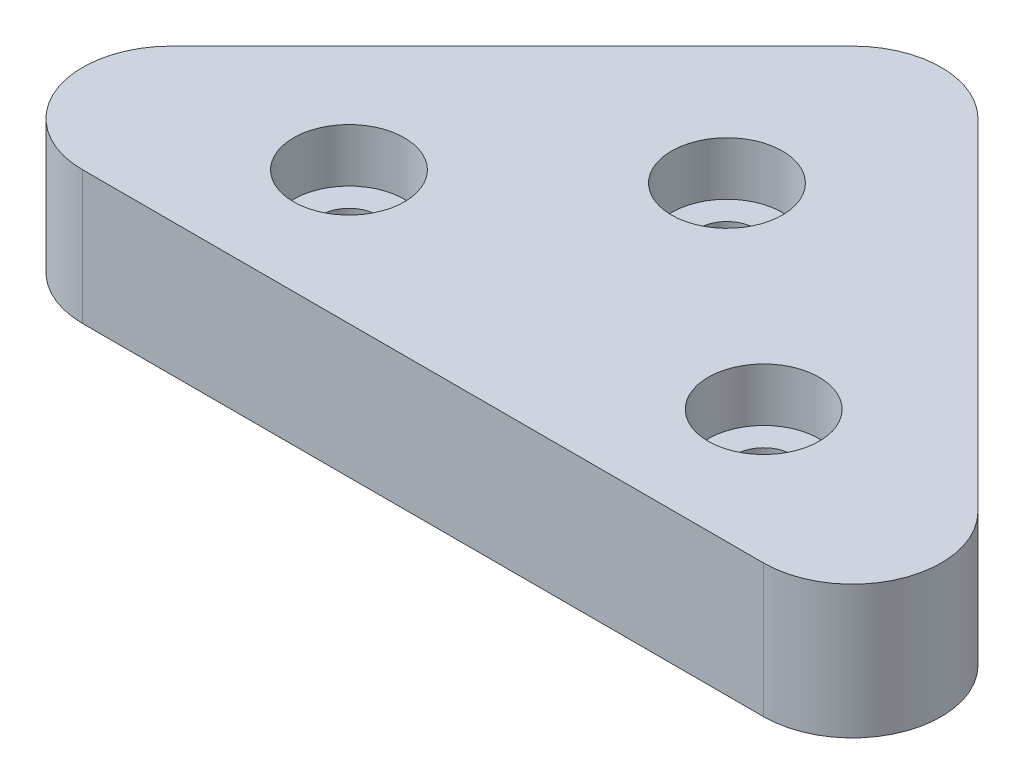
ISO-10303-21;
HEADER;
FILE_DESCRIPTION(('STEP AP214'),'2;1');
FILE_NAME('part.step','',(''),(''),'','','');
FILE_SCHEMA(('AUTOMOTIVE_DESIGN { 1 0 10303 214 1 1 1 1 }'));
ENDSEC;
DATA;
#1=APPLICATION_CONTEXT('core data for automotive mechanical design processes');
#2=APPLICATION_PROTOCOL_DEFINITION('international standard','automotive_design',2000,#1);
#3=PRODUCT_CONTEXT('',#1,'mechanical');
#4=PRODUCT('Part','Part','',(#3));
#5=PRODUCT_RELATED_PRODUCT_CATEGORY('part','',(#4));
#6=PRODUCT_DEFINITION_FORMATION('','',#4);
#7=PRODUCT_DEFINITION_CONTEXT('part definition',#1,'design');
#8=PRODUCT_DEFINITION('design','',#6,#7);
#9=PRODUCT_DEFINITION_SHAPE('','',#8);
#10=(LENGTH_UNIT() NAMED_UNIT(*) SI_UNIT(.MILLI.,.METRE.));
#11=(NAMED_UNIT(*) PLANE_ANGLE_UNIT() SI_UNIT($,.RADIAN.));
#12=(NAMED_UNIT(*) SI_UNIT($,.STERADIAN.) SOLID_ANGLE_UNIT());
#13=UNCERTAINTY_MEASURE_WITH_UNIT(LENGTH_MEASURE(1.E-05),#10,'distance_accuracy_value','');
#14=(GEOMETRIC_REPRESENTATION_CONTEXT(3) GLOBAL_UNCERTAINTY_ASSIGNED_CONTEXT((#13)) GLOBAL_UNIT_ASSIGNED_CONTEXT((#10,
#11,#12)) REPRESENTATION_CONTEXT('',''));
#15=CARTESIAN_POINT('',(0.,0.,0.));
#16=DIRECTION('',(0.,0.,1.));
#17=DIRECTION('',(1.,0.,0.));
#18=AXIS2_PLACEMENT_3D('',#15,#16,#17);
#19=CARTESIAN_POINT('',(0.,3.81,0.));
#20=DIRECTION('',(0.,0.,1.));
#21=DIRECTION('',(1.,0.,0.));
#22=AXIS2_PLACEMENT_3D('',#19,#20,#21);
#23=PLANE('',#22);
#24=DIRECTION('',(-1.,0.,0.));
#25=VECTOR('',#24,1.);
#26=CARTESIAN_POINT('',(0.,3.81,0.));
#27=LINE('',#26,#25);
#28=CARTESIAN_POINT('',(25.6178975515723,3.81,0.));
#29=VERTEX_POINT('',#28);
#30=CARTESIAN_POINT('',(6.1321024484277,3.81,0.));
#31=VERTEX_POINT('',#30);
#32=EDGE_CURVE('E135',#29,#31,#27,.T.);
#33=ORIENTED_EDGE('',*,*,#32,.T.);
#34=DIRECTION('',(0.,-1.,0.));
#35=VECTOR('',#34,1.);
#36=CARTESIAN_POINT('',(6.1321024484277,3.81,0.));
#37=LINE('',#36,#35);
#38=CARTESIAN_POINT('',(6.1321024484277,0.,0.));
#39=VERTEX_POINT('',#38);
#40=EDGE_CURVE('E11',#31,#39,#37,.T.);
#41=ORIENTED_EDGE('',*,*,#40,.T.);
#42=DIRECTION('',(-1.,0.,0.));
#43=VECTOR('',#42,1.);
#44=CARTESIAN_POINT('',(0.,0.,0.));
#45=LINE('',#44,#43);
#46=CARTESIAN_POINT('',(25.6178975515723,0.,0.));
#47=VERTEX_POINT('',#46);
#48=EDGE_CURVE('E134',#47,#39,#45,.T.);
#49=ORIENTED_EDGE('',*,*,#48,.F.);
#50=DIRECTION('',(0.,-1.,0.));
#51=VECTOR('',#50,1.);
#52=CARTESIAN_POINT('',(25.6178975515723,3.81,0.));
#53=LINE('',#52,#51);
#54=EDGE_CURVE('E40',#47,#29,#53,.F.);
#55=ORIENTED_EDGE('',*,*,#54,.T.);
#56=EDGE_LOOP('',(#33,#41,#49,#55));
#57=FACE_BOUND('',#56,.T.);
#58=ADVANCED_FACE('F32',(#57),#23,.T.);
#59=CARTESIAN_POINT('',(15.8749999999998,3.81,-15.875));
#60=DIRECTION('',(0.707106781186544,0.,-0.707106781186551));
#61=DIRECTION('',(-0.707106781186551,0.,-0.707106781186544));
#62=AXIS2_PLACEMENT_3D('',#59,#60,#61);
#63=PLANE('',#62);
#64=DIRECTION('',(0.707106781186551,0.,0.707106781186544));
#65=VECTOR('',#64,1.);
#66=CARTESIAN_POINT('',(15.8749999999998,0.,-15.875));
#67=LINE('',#66,#65);
#68=CARTESIAN_POINT('',(17.6710512242138,0.,-14.078948775786));
#69=VERTEX_POINT('',#68);
#70=CARTESIAN_POINT('',(27.4139487757861,0.,-4.33605122421382));
#71=VERTEX_POINT('',#70);
#72=EDGE_CURVE('E147',#69,#71,#67,.T.);
#73=ORIENTED_EDGE('',*,*,#72,.F.);
#74=DIRECTION('',(0.,-1.,0.));
#75=VECTOR('',#74,1.);
#76=CARTESIAN_POINT('',(17.6710512242138,3.81,-14.078948775786));
#77=LINE('',#76,#75);
#78=CARTESIAN_POINT('',(17.6710512242138,3.81,-14.078948775786));
#79=VERTEX_POINT('',#78);
#80=EDGE_CURVE('E165',#69,#79,#77,.F.);
#81=ORIENTED_EDGE('',*,*,#80,.T.);
#82=DIRECTION('',(0.707106781186551,0.,0.707106781186544));
#83=VECTOR('',#82,1.);
#84=CARTESIAN_POINT('',(15.8749999999998,3.81,-15.875));
#85=LINE('',#84,#83);
#86=CARTESIAN_POINT('',(27.4139487757861,3.81,-4.33605122421382));
#87=VERTEX_POINT('',#86);
#88=EDGE_CURVE('E137',#79,#87,#85,.T.);
#89=ORIENTED_EDGE('',*,*,#88,.T.);
#90=DIRECTION('',(0.,-1.,0.));
#91=VECTOR('',#90,1.);
#92=CARTESIAN_POINT('',(27.4139487757861,3.81,-4.33605122421382));
#93=LINE('',#92,#91);
#94=EDGE_CURVE('E162',#87,#71,#93,.T.);
#95=ORIENTED_EDGE('',*,*,#94,.T.);
#96=EDGE_LOOP('',(#73,#81,#89,#95));
#97=FACE_BOUND('',#96,.T.);
#98=ADVANCED_FACE('F186',(#97),#63,.T.);
#99=CARTESIAN_POINT('',(0.,3.81,0.));
#100=DIRECTION('',(-0.707106781186544,0.,-0.707106781186551));
#101=DIRECTION('',(-0.707106781186551,0.,0.707106781186544));
#102=AXIS2_PLACEMENT_3D('',#99,#100,#101);
#103=PLANE('',#102);
#104=DIRECTION('',(0.707106781186551,0.,-0.707106781186544));
#105=VECTOR('',#104,1.);
#106=CARTESIAN_POINT('',(0.,3.81,0.));
#107=LINE('',#106,#105);
#108=CARTESIAN_POINT('',(4.33605122421388,3.81,-4.33605122421384));
#109=VERTEX_POINT('',#108);
#110=CARTESIAN_POINT('',(14.0789487757862,3.81,-14.078948775786));
#111=VERTEX_POINT('',#110);
#112=EDGE_CURVE('E141',#109,#111,#107,.T.);
#113=ORIENTED_EDGE('',*,*,#112,.T.);
#114=DIRECTION('',(0.,-1.,0.));
#115=VECTOR('',#114,1.);
#116=CARTESIAN_POINT('',(14.0789487757862,3.81,-14.078948775786));
#117=LINE('',#116,#115);
#118=CARTESIAN_POINT('',(14.0789487757862,0.,-14.078948775786));
#119=VERTEX_POINT('',#118);
#120=EDGE_CURVE('E153',#111,#119,#117,.T.);
#121=ORIENTED_EDGE('',*,*,#120,.T.);
#122=DIRECTION('',(0.707106781186551,0.,-0.707106781186544));
#123=VECTOR('',#122,1.);
#124=CARTESIAN_POINT('',(0.,0.,0.));
#125=LINE('',#124,#123);
#126=CARTESIAN_POINT('',(4.33605122421388,0.,-4.33605122421384));
#127=VERTEX_POINT('',#126);
#128=EDGE_CURVE('E138',#127,#119,#125,.T.);
#129=ORIENTED_EDGE('',*,*,#128,.F.);
#130=DIRECTION('',(0.,-1.,0.));
#131=VECTOR('',#130,1.);
#132=CARTESIAN_POINT('',(4.33605122421388,3.81,-4.33605122421384));
#133=LINE('',#132,#131);
#134=EDGE_CURVE('E144',#127,#109,#133,.F.);
#135=ORIENTED_EDGE('',*,*,#134,.T.);
#136=EDGE_LOOP('',(#113,#121,#129,#135));
#137=FACE_BOUND('',#136,.T.);
#138=ADVANCED_FACE('F178',(#137),#103,.T.);
#139=CARTESIAN_POINT('',(0.,3.81,0.));
#140=DIRECTION('',(0.,1.,0.));
#141=DIRECTION('',(0.,0.,1.));
#142=AXIS2_PLACEMENT_3D('',#139,#140,#141);
#143=PLANE('',#142);
#144=CARTESIAN_POINT('',(9.9421024484277,3.81,-3.80999999999999));
#145=DIRECTION('',(0.,1.,0.));
#146=DIRECTION('',(0.,0.,1.));
#147=AXIS2_PLACEMENT_3D('',#144,#145,#146);
#148=CIRCLE('',#147,1.5875);
#149=CARTESIAN_POINT('',(9.9421024484277,3.81,-2.22249999999999));
#150=VERTEX_POINT('',#149);
#151=EDGE_CURVE('E260',#150,#150,#148,.T.);
#152=ORIENTED_EDGE('',*,*,#151,.F.);
#153=EDGE_LOOP('',(#152));
#154=FACE_BOUND('',#153,.T.);
#155=CARTESIAN_POINT('',(15.6774281437701,3.81,-8.88999999999999));
#156=DIRECTION('',(0.,1.,0.));
#157=DIRECTION('',(0.,0.,1.));
#158=AXIS2_PLACEMENT_3D('',#155,#156,#157);
#159=CIRCLE('',#158,1.5875);
#160=CARTESIAN_POINT('',(15.6774281437701,3.81,-7.30249999999999));
#161=VERTEX_POINT('',#160);
#162=EDGE_CURVE('E103',#161,#161,#159,.T.);
#163=ORIENTED_EDGE('',*,*,#162,.F.);
#164=EDGE_LOOP('',(#163));
#165=FACE_BOUND('',#164,.T.);
#166=CARTESIAN_POINT('',(21.8078975515723,3.81,-3.80999999999999));
#167=DIRECTION('',(0.,1.,0.));
#168=DIRECTION('',(0.,0.,1.));
#169=AXIS2_PLACEMENT_3D('',#166,#167,#168);
#170=CIRCLE('',#169,1.5875);
#171=CARTESIAN_POINT('',(21.8078975515723,3.81,-2.22249999999999));
#172=VERTEX_POINT('',#171);
#173=EDGE_CURVE('E122',#172,#172,#170,.T.);
#174=ORIENTED_EDGE('',*,*,#173,.F.);
#175=EDGE_LOOP('',(#174));
#176=FACE_BOUND('',#175,.T.);
#177=ORIENTED_EDGE('',*,*,#88,.F.);
#178=CARTESIAN_POINT('',(15.875,3.81,-12.2828975515722));
#179=DIRECTION('',(0.,1.,0.));
#180=DIRECTION('',(0.,0.,1.));
#181=AXIS2_PLACEMENT_3D('',#178,#179,#180);
#182=CIRCLE('',#181,2.54);
#183=EDGE_CURVE('E170',#79,#111,#182,.T.);
#184=ORIENTED_EDGE('',*,*,#183,.T.);
#185=ORIENTED_EDGE('',*,*,#112,.F.);
#186=CARTESIAN_POINT('',(6.1321024484277,3.81,-2.54));
#187=DIRECTION('',(0.,1.,0.));
#188=DIRECTION('',(0.,0.,1.));
#189=AXIS2_PLACEMENT_3D('',#186,#187,#188);
#190=CIRCLE('',#189,2.54);
#191=EDGE_CURVE('E47',#109,#31,#190,.T.);
#192=ORIENTED_EDGE('',*,*,#191,.T.);
#193=ORIENTED_EDGE('',*,*,#32,.F.);
#194=CARTESIAN_POINT('',(25.6178975515723,3.81,-2.53999999999998));
#195=DIRECTION('',(0.,1.,0.));
#196=DIRECTION('',(0.,0.,1.));
#197=AXIS2_PLACEMENT_3D('',#194,#195,#196);
#198=CIRCLE('',#197,2.54);
#199=EDGE_CURVE('E167',#29,#87,#198,.T.);
#200=ORIENTED_EDGE('',*,*,#199,.T.);
#201=EDGE_LOOP('',(#177,#184,#185,#192,#193,#200));
#202=FACE_BOUND('',#201,.T.);
#203=ADVANCED_FACE('F173',(#154,#165,#176,#202),#143,.T.);
#204=CARTESIAN_POINT('',(0.,0.,0.));
#205=DIRECTION('',(0.,1.,0.));
#206=DIRECTION('',(0.,0.,1.));
#207=AXIS2_PLACEMENT_3D('',#204,#205,#206);
#208=PLANE('',#207);
#209=ORIENTED_EDGE('',*,*,#128,.T.);
#210=CARTESIAN_POINT('',(15.875,0.,-12.2828975515722));
#211=DIRECTION('',(0.,1.,0.));
#212=DIRECTION('',(0.,0.,1.));
#213=AXIS2_PLACEMENT_3D('',#210,#211,#212);
#214=CIRCLE('',#213,2.54);
#215=EDGE_CURVE('E160',#119,#69,#214,.F.);
#216=ORIENTED_EDGE('',*,*,#215,.T.);
#217=ORIENTED_EDGE('',*,*,#72,.T.);
#218=CARTESIAN_POINT('',(25.6178975515723,0.,-2.53999999999998));
#219=DIRECTION('',(0.,1.,0.));
#220=DIRECTION('',(0.,0.,1.));
#221=AXIS2_PLACEMENT_3D('',#218,#219,#220);
#222=CIRCLE('',#221,2.54);
#223=EDGE_CURVE('E156',#71,#47,#222,.F.);
#224=ORIENTED_EDGE('',*,*,#223,.T.);
#225=ORIENTED_EDGE('',*,*,#48,.T.);
#226=CARTESIAN_POINT('',(6.1321024484277,0.,-2.54));
#227=DIRECTION('',(0.,1.,0.));
#228=DIRECTION('',(0.,0.,1.));
#229=AXIS2_PLACEMENT_3D('',#226,#227,#228);
#230=CIRCLE('',#229,2.54);
#231=EDGE_CURVE('E158',#39,#127,#230,.F.);
#232=ORIENTED_EDGE('',*,*,#231,.T.);
#233=EDGE_LOOP('',(#209,#216,#217,#224,#225,#232));
#234=FACE_BOUND('',#233,.T.);
#235=ADVANCED_FACE('F184',(#234),#208,.F.);
#236=CARTESIAN_POINT('',(15.875,3.81,-12.2828975515722));
#237=DIRECTION('',(0.,-1.,0.));
#238=DIRECTION('',(0.,0.,-1.));
#239=AXIS2_PLACEMENT_3D('',#236,#237,#238);
#240=CYLINDRICAL_SURFACE('',#239,2.54);
#241=ORIENTED_EDGE('',*,*,#183,.F.);
#242=ORIENTED_EDGE('',*,*,#80,.F.);
#243=ORIENTED_EDGE('',*,*,#215,.F.);
#244=ORIENTED_EDGE('',*,*,#120,.F.);
#245=EDGE_LOOP('',(#241,#242,#243,#244));
#246=FACE_BOUND('',#245,.T.);
#247=ADVANCED_FACE('F181',(#246),#240,.T.);
#248=CARTESIAN_POINT('',(6.1321024484277,3.81,-2.54));
#249=DIRECTION('',(0.,-1.,0.));
#250=DIRECTION('',(0.,0.,-1.));
#251=AXIS2_PLACEMENT_3D('',#248,#249,#250);
#252=CYLINDRICAL_SURFACE('',#251,2.54);
#253=ORIENTED_EDGE('',*,*,#191,.F.);
#254=ORIENTED_EDGE('',*,*,#134,.F.);
#255=ORIENTED_EDGE('',*,*,#231,.F.);
#256=ORIENTED_EDGE('',*,*,#40,.F.);
#257=EDGE_LOOP('',(#253,#254,#255,#256));
#258=FACE_BOUND('',#257,.T.);
#259=ADVANCED_FACE('F192',(#258),#252,.T.);
#260=CARTESIAN_POINT('',(25.6178975515723,3.81,-2.53999999999998));
#261=DIRECTION('',(0.,-1.,0.));
#262=DIRECTION('',(0.,0.,-1.));
#263=AXIS2_PLACEMENT_3D('',#260,#261,#262);
#264=CYLINDRICAL_SURFACE('',#263,2.54);
#265=ORIENTED_EDGE('',*,*,#199,.F.);
#266=ORIENTED_EDGE('',*,*,#54,.F.);
#267=ORIENTED_EDGE('',*,*,#223,.F.);
#268=ORIENTED_EDGE('',*,*,#94,.F.);
#269=EDGE_LOOP('',(#265,#266,#267,#268));
#270=FACE_BOUND('',#269,.T.);
#271=ADVANCED_FACE('F34',(#270),#264,.T.);
#272=CARTESIAN_POINT('',(21.8078975515723,0.508000000000001,-3.80999999999999));
#273=DIRECTION('',(0.,1.,0.));
#274=DIRECTION('',(0.,0.,1.));
#275=AXIS2_PLACEMENT_3D('',#272,#273,#274);
#276=CONICAL_SURFACE('',#275,0.80645,1.02974425867666);
#277=CARTESIAN_POINT('',(21.8078975515723,0.0234359537852253,-3.80999999999999));
#278=VERTEX_POINT('',#277);
#279=VERTEX_LOOP('',#278);
#280=FACE_BOUND('',#279,.T.);
#281=CARTESIAN_POINT('',(21.8078975515723,0.508000000000001,-3.80999999999999));
#282=DIRECTION('',(0.,1.,0.));
#283=DIRECTION('',(0.,0.,1.));
#284=AXIS2_PLACEMENT_3D('',#281,#282,#283);
#285=CIRCLE('',#284,0.80645);
#286=CARTESIAN_POINT('',(21.8078975515723,0.508000000000001,-3.00354999999999));
#287=VERTEX_POINT('',#286);
#288=EDGE_CURVE('E131',#287,#287,#285,.T.);
#289=ORIENTED_EDGE('',*,*,#288,.T.);
#290=EDGE_LOOP('',(#289));
#291=FACE_BOUND('',#290,.T.);
#292=ADVANCED_FACE('F198',(#280,#291),#276,.F.);
#293=CARTESIAN_POINT('',(21.8078975515723,3.81,-3.80999999999999));
#294=DIRECTION('',(0.,1.,0.));
#295=DIRECTION('',(0.,0.,1.));
#296=AXIS2_PLACEMENT_3D('',#293,#294,#295);
#297=CYLINDRICAL_SURFACE('',#296,0.80645);
#298=ORIENTED_EDGE('',*,*,#288,.F.);
#299=EDGE_LOOP('',(#298));
#300=FACE_BOUND('',#299,.T.);
#301=CARTESIAN_POINT('',(21.8078975515723,2.286,-3.80999999999999));
#302=DIRECTION('',(0.,1.,0.));
#303=DIRECTION('',(0.,0.,1.));
#304=AXIS2_PLACEMENT_3D('',#301,#302,#303);
#305=CIRCLE('',#304,0.80645);
#306=CARTESIAN_POINT('',(21.8078975515723,2.286,-3.00354999999999));
#307=VERTEX_POINT('',#306);
#308=EDGE_CURVE('E128',#307,#307,#305,.T.);
#309=ORIENTED_EDGE('',*,*,#308,.T.);
#310=EDGE_LOOP('',(#309));
#311=FACE_BOUND('',#310,.T.);
#312=ADVANCED_FACE('F216',(#300,#311),#297,.F.);
#313=CARTESIAN_POINT('',(22.6143475515723,2.286,-3.80999999999999));
#314=DIRECTION('',(0.,-1.,0.));
#315=DIRECTION('',(0.,0.,-1.));
#316=AXIS2_PLACEMENT_3D('',#313,#314,#315);
#317=PLANE('',#316);
#318=ORIENTED_EDGE('',*,*,#308,.F.);
#319=EDGE_LOOP('',(#318));
#320=FACE_BOUND('',#319,.T.);
#321=CARTESIAN_POINT('',(21.8078975515723,2.286,-3.80999999999999));
#322=DIRECTION('',(0.,1.,0.));
#323=DIRECTION('',(0.,0.,1.));
#324=AXIS2_PLACEMENT_3D('',#321,#322,#323);
#325=CIRCLE('',#324,1.5875);
#326=CARTESIAN_POINT('',(21.8078975515723,2.286,-2.22249999999999));
#327=VERTEX_POINT('',#326);
#328=EDGE_CURVE('E125',#327,#327,#325,.T.);
#329=ORIENTED_EDGE('',*,*,#328,.T.);
#330=EDGE_LOOP('',(#329));
#331=FACE_BOUND('',#330,.T.);
#332=ADVANCED_FACE('F220',(#320,#331),#317,.F.);
#333=CARTESIAN_POINT('',(21.8078975515723,3.81,-3.80999999999999));
#334=DIRECTION('',(0.,1.,0.));
#335=DIRECTION('',(0.,0.,1.));
#336=AXIS2_PLACEMENT_3D('',#333,#334,#335);
#337=CYLINDRICAL_SURFACE('',#336,1.5875);
#338=ORIENTED_EDGE('',*,*,#328,.F.);
#339=EDGE_LOOP('',(#338));
#340=FACE_BOUND('',#339,.T.);
#341=ORIENTED_EDGE('',*,*,#173,.T.);
#342=EDGE_LOOP('',(#341));
#343=FACE_BOUND('',#342,.T.);
#344=ADVANCED_FACE('F224',(#340,#343),#337,.F.);
#345=CARTESIAN_POINT('',(15.6774281437701,0.508000000000001,-8.88999999999999));
#346=DIRECTION('',(0.,1.,0.));
#347=DIRECTION('',(0.,0.,1.));
#348=AXIS2_PLACEMENT_3D('',#345,#346,#347);
#349=CONICAL_SURFACE('',#348,0.806449999999997,1.02974425867665);
#350=CARTESIAN_POINT('',(15.6774281437701,0.0234359537852253,-8.88999999999999));
#351=VERTEX_POINT('',#350);
#352=VERTEX_LOOP('',#351);
#353=FACE_BOUND('',#352,.T.);
#354=CARTESIAN_POINT('',(15.6774281437701,0.508000000000001,-8.88999999999999));
#355=DIRECTION('',(0.,1.,0.));
#356=DIRECTION('',(0.,0.,1.));
#357=AXIS2_PLACEMENT_3D('',#354,#355,#356);
#358=CIRCLE('',#357,0.806449999999997);
#359=CARTESIAN_POINT('',(15.6774281437701,0.508000000000001,-8.08354999999999));
#360=VERTEX_POINT('',#359);
#361=EDGE_CURVE('E119',#360,#360,#358,.T.);
#362=ORIENTED_EDGE('',*,*,#361,.T.);
#363=EDGE_LOOP('',(#362));
#364=FACE_BOUND('',#363,.T.);
#365=ADVANCED_FACE('F228',(#353,#364),#349,.F.);
#366=CARTESIAN_POINT('',(15.6774281437701,3.81,-8.88999999999999));
#367=DIRECTION('',(0.,1.,0.));
#368=DIRECTION('',(0.,0.,1.));
#369=AXIS2_PLACEMENT_3D('',#366,#367,#368);
#370=CYLINDRICAL_SURFACE('',#369,0.806449999999998);
#371=ORIENTED_EDGE('',*,*,#361,.F.);
#372=EDGE_LOOP('',(#371));
#373=FACE_BOUND('',#372,.T.);
#374=CARTESIAN_POINT('',(15.6774281437701,2.286,-8.88999999999999));
#375=DIRECTION('',(0.,1.,0.));
#376=DIRECTION('',(0.,0.,1.));
#377=AXIS2_PLACEMENT_3D('',#374,#375,#376);
#378=CIRCLE('',#377,0.80645);
#379=CARTESIAN_POINT('',(15.6774281437701,2.286,-8.08354999999999));
#380=VERTEX_POINT('',#379);
#381=EDGE_CURVE('E116',#380,#380,#378,.T.);
#382=ORIENTED_EDGE('',*,*,#381,.T.);
#383=EDGE_LOOP('',(#382));
#384=FACE_BOUND('',#383,.T.);
#385=ADVANCED_FACE('F232',(#373,#384),#370,.F.);
#386=CARTESIAN_POINT('',(16.4838781437701,2.286,-8.88999999999999));
#387=DIRECTION('',(0.,-1.,0.));
#388=DIRECTION('',(0.,0.,-1.));
#389=AXIS2_PLACEMENT_3D('',#386,#387,#388);
#390=PLANE('',#389);
#391=ORIENTED_EDGE('',*,*,#381,.F.);
#392=EDGE_LOOP('',(#391));
#393=FACE_BOUND('',#392,.T.);
#394=CARTESIAN_POINT('',(15.6774281437701,2.286,-8.88999999999999));
#395=DIRECTION('',(0.,1.,0.));
#396=DIRECTION('',(0.,0.,1.));
#397=AXIS2_PLACEMENT_3D('',#394,#395,#396);
#398=CIRCLE('',#397,1.5875);
#399=CARTESIAN_POINT('',(15.6774281437701,2.286,-7.30249999999999));
#400=VERTEX_POINT('',#399);
#401=EDGE_CURVE('E107',#400,#400,#398,.T.);
#402=ORIENTED_EDGE('',*,*,#401,.T.);
#403=EDGE_LOOP('',(#402));
#404=FACE_BOUND('',#403,.T.);
#405=ADVANCED_FACE('F236',(#393,#404),#390,.F.);
#406=CARTESIAN_POINT('',(15.6774281437701,3.81,-8.88999999999999));
#407=DIRECTION('',(0.,1.,0.));
#408=DIRECTION('',(0.,0.,1.));
#409=AXIS2_PLACEMENT_3D('',#406,#407,#408);
#410=CYLINDRICAL_SURFACE('',#409,1.5875);
#411=ORIENTED_EDGE('',*,*,#401,.F.);
#412=EDGE_LOOP('',(#411));
#413=FACE_BOUND('',#412,.T.);
#414=ORIENTED_EDGE('',*,*,#162,.T.);
#415=EDGE_LOOP('',(#414));
#416=FACE_BOUND('',#415,.T.);
#417=ADVANCED_FACE('F97',(#413,#416),#410,.F.);
#418=CARTESIAN_POINT('',(9.9421024484277,0.508000000000001,-3.80999999999999));
#419=DIRECTION('',(0.,1.,0.));
#420=DIRECTION('',(0.,0.,1.));
#421=AXIS2_PLACEMENT_3D('',#418,#419,#420);
#422=CONICAL_SURFACE('',#421,0.806449999999998,1.02974425867665);
#423=CARTESIAN_POINT('',(9.9421024484277,0.0234359537852253,-3.80999999999999));
#424=VERTEX_POINT('',#423);
#425=VERTEX_LOOP('',#424);
#426=FACE_BOUND('',#425,.T.);
#427=CARTESIAN_POINT('',(9.9421024484277,0.508000000000001,-3.80999999999999));
#428=DIRECTION('',(0.,1.,0.));
#429=DIRECTION('',(0.,0.,1.));
#430=AXIS2_PLACEMENT_3D('',#427,#428,#429);
#431=CIRCLE('',#430,0.806449999999998);
#432=CARTESIAN_POINT('',(9.9421024484277,0.508000000000001,-3.00354999999999));
#433=VERTEX_POINT('',#432);
#434=EDGE_CURVE('E101',#433,#433,#431,.T.);
#435=ORIENTED_EDGE('',*,*,#434,.T.);
#436=EDGE_LOOP('',(#435));
#437=FACE_BOUND('',#436,.T.);
#438=ADVANCED_FACE('F93',(#426,#437),#422,.F.);
#439=CARTESIAN_POINT('',(9.9421024484277,3.81,-3.80999999999999));
#440=DIRECTION('',(0.,1.,0.));
#441=DIRECTION('',(0.,0.,1.));
#442=AXIS2_PLACEMENT_3D('',#439,#440,#441);
#443=CYLINDRICAL_SURFACE('',#442,0.806449999999998);
#444=ORIENTED_EDGE('',*,*,#434,.F.);
#445=EDGE_LOOP('',(#444));
#446=FACE_BOUND('',#445,.T.);
#447=CARTESIAN_POINT('',(9.9421024484277,2.286,-3.80999999999999));
#448=DIRECTION('',(0.,1.,0.));
#449=DIRECTION('',(0.,0.,1.));
#450=AXIS2_PLACEMENT_3D('',#447,#448,#449);
#451=CIRCLE('',#450,0.806449999999998);
#452=CARTESIAN_POINT('',(9.9421024484277,2.286,-3.00354999999999));
#453=VERTEX_POINT('',#452);
#454=EDGE_CURVE('E104',#453,#453,#451,.T.);
#455=ORIENTED_EDGE('',*,*,#454,.T.);
#456=EDGE_LOOP('',(#455));
#457=FACE_BOUND('',#456,.T.);
#458=ADVANCED_FACE('F96',(#446,#457),#443,.F.);
#459=CARTESIAN_POINT('',(10.7485524484277,2.286,-3.80999999999999));
#460=DIRECTION('',(0.,-1.,0.));
#461=DIRECTION('',(0.,0.,-1.));
#462=AXIS2_PLACEMENT_3D('',#459,#460,#461);
#463=PLANE('',#462);
#464=ORIENTED_EDGE('',*,*,#454,.F.);
#465=EDGE_LOOP('',(#464));
#466=FACE_BOUND('',#465,.T.);
#467=CARTESIAN_POINT('',(9.9421024484277,2.286,-3.80999999999999));
#468=DIRECTION('',(0.,1.,0.));
#469=DIRECTION('',(0.,0.,1.));
#470=AXIS2_PLACEMENT_3D('',#467,#468,#469);
#471=CIRCLE('',#470,1.5875);
#472=CARTESIAN_POINT('',(9.9421024484277,2.286,-2.22249999999999));
#473=VERTEX_POINT('',#472);
#474=EDGE_CURVE('E110',#473,#473,#471,.T.);
#475=ORIENTED_EDGE('',*,*,#474,.T.);
#476=EDGE_LOOP('',(#475));
#477=FACE_BOUND('',#476,.T.);
#478=ADVANCED_FACE('F246',(#466,#477),#463,.F.);
#479=CARTESIAN_POINT('',(9.9421024484277,3.81,-3.80999999999999));
#480=DIRECTION('',(0.,1.,0.));
#481=DIRECTION('',(0.,0.,1.));
#482=AXIS2_PLACEMENT_3D('',#479,#480,#481);
#483=CYLINDRICAL_SURFACE('',#482,1.5875);
#484=ORIENTED_EDGE('',*,*,#474,.F.);
#485=EDGE_LOOP('',(#484));
#486=FACE_BOUND('',#485,.T.);
#487=ORIENTED_EDGE('',*,*,#151,.T.);
#488=EDGE_LOOP('',(#487));
#489=FACE_BOUND('',#488,.T.);
#490=ADVANCED_FACE('F249',(#486,#489),#483,.F.);
#491=CLOSED_SHELL('',(#58,#98,#138,#203,#235,#247,#259,#271,#292,#312,#332,#344,#365,#385,#405,
#417,#438,#458,#478,#490));
#492=MANIFOLD_SOLID_BREP('B2',#491);
#493=ADVANCED_BREP_SHAPE_REPRESENTATION('',(#18,#492),#14);
#494=SHAPE_DEFINITION_REPRESENTATION(#9,#493);
ENDSEC;
END-ISO-10303-21;
